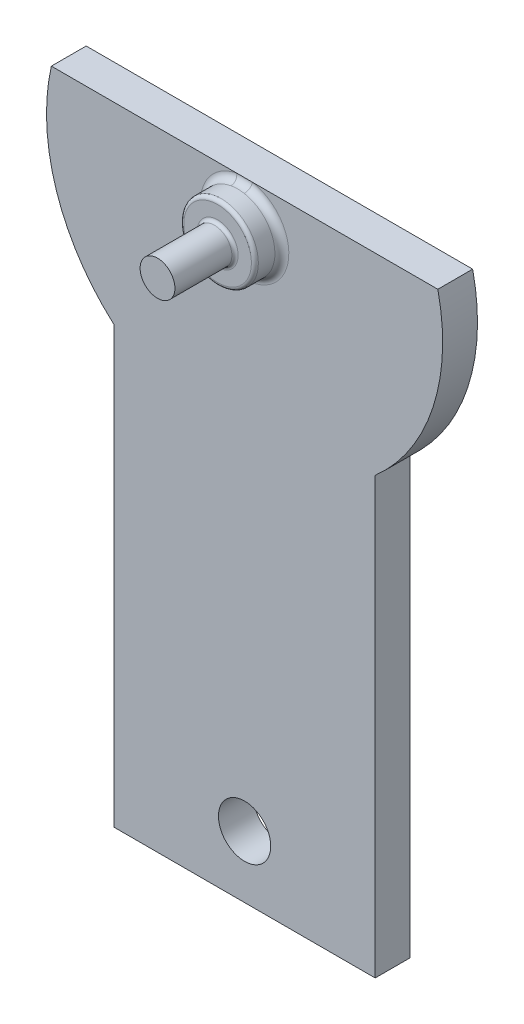
ISO-10303-21;
HEADER;
FILE_DESCRIPTION(('STEP AP214'),'2;1');
FILE_NAME('part.step','',(''),(''),'','','');
FILE_SCHEMA(('AUTOMOTIVE_DESIGN { 1 0 10303 214 1 1 1 1 }'));
ENDSEC;
DATA;
#1=APPLICATION_CONTEXT('core data for automotive mechanical design processes');
#2=APPLICATION_PROTOCOL_DEFINITION('international standard','automotive_design',2000,#1);
#3=PRODUCT_CONTEXT('',#1,'mechanical');
#4=PRODUCT('Part','Part','',(#3));
#5=PRODUCT_RELATED_PRODUCT_CATEGORY('part','',(#4));
#6=PRODUCT_DEFINITION_FORMATION('','',#4);
#7=PRODUCT_DEFINITION_CONTEXT('part definition',#1,'design');
#8=PRODUCT_DEFINITION('design','',#6,#7);
#9=PRODUCT_DEFINITION_SHAPE('','',#8);
#10=(LENGTH_UNIT() NAMED_UNIT(*) SI_UNIT(.MILLI.,.METRE.));
#11=(NAMED_UNIT(*) PLANE_ANGLE_UNIT() SI_UNIT($,.RADIAN.));
#12=(NAMED_UNIT(*) SI_UNIT($,.STERADIAN.) SOLID_ANGLE_UNIT());
#13=UNCERTAINTY_MEASURE_WITH_UNIT(LENGTH_MEASURE(1.E-05),#10,'distance_accuracy_value','');
#14=(GEOMETRIC_REPRESENTATION_CONTEXT(3) GLOBAL_UNCERTAINTY_ASSIGNED_CONTEXT((#13)) GLOBAL_UNIT_ASSIGNED_CONTEXT((#10,
#11,#12)) REPRESENTATION_CONTEXT('',''));
#15=CARTESIAN_POINT('',(0.,0.,0.));
#16=DIRECTION('',(0.,0.,1.));
#17=DIRECTION('',(1.,0.,0.));
#18=AXIS2_PLACEMENT_3D('',#15,#16,#17);
#19=CARTESIAN_POINT('',(75.,0.,20.));
#20=DIRECTION('',(-1.,0.,0.));
#21=DIRECTION('',(0.,-1.,0.));
#22=AXIS2_PLACEMENT_3D('',#19,#20,#21);
#23=PLANE('',#22);
#24=DIRECTION('',(0.,1.,0.));
#25=VECTOR('',#24,1.);
#26=CARTESIAN_POINT('',(75.,0.,0.));
#27=LINE('',#26,#25);
#28=CARTESIAN_POINT('',(75.,-335.522292415487,0.));
#29=VERTEX_POINT('',#28);
#30=CARTESIAN_POINT('',(75.,-85.5222924154866,0.));
#31=VERTEX_POINT('',#30);
#32=EDGE_CURVE('E136',#29,#31,#27,.T.);
#33=ORIENTED_EDGE('',*,*,#32,.T.);
#34=DIRECTION('',(0.,0.,-1.));
#35=VECTOR('',#34,1.);
#36=CARTESIAN_POINT('',(75.,-85.5222924154866,20.));
#37=LINE('',#36,#35);
#38=CARTESIAN_POINT('',(75.,-85.5222924154866,20.));
#39=VERTEX_POINT('',#38);
#40=EDGE_CURVE('E118',#39,#31,#37,.T.);
#41=ORIENTED_EDGE('',*,*,#40,.F.);
#42=DIRECTION('',(0.,1.,0.));
#43=VECTOR('',#42,1.);
#44=CARTESIAN_POINT('',(75.,0.,20.));
#45=LINE('',#44,#43);
#46=CARTESIAN_POINT('',(75.,-335.522292415487,20.));
#47=VERTEX_POINT('',#46);
#48=EDGE_CURVE('E123',#47,#39,#45,.T.);
#49=ORIENTED_EDGE('',*,*,#48,.F.);
#50=DIRECTION('',(0.,0.,-1.));
#51=VECTOR('',#50,1.);
#52=CARTESIAN_POINT('',(75.,-335.522292415487,20.));
#53=LINE('',#52,#51);
#54=EDGE_CURVE('E278',#47,#29,#53,.T.);
#55=ORIENTED_EDGE('',*,*,#54,.T.);
#56=EDGE_LOOP('',(#33,#41,#49,#55));
#57=FACE_BOUND('',#56,.T.);
#58=ADVANCED_FACE('F43',(#57),#23,.F.);
#59=CARTESIAN_POINT('',(0.,0.,20.));
#60=DIRECTION('',(0.,0.,-1.));
#61=DIRECTION('',(-1.,0.,0.));
#62=AXIS2_PLACEMENT_3D('',#59,#60,#61);
#63=CYLINDRICAL_SURFACE('',#62,113.75);
#64=CARTESIAN_POINT('',(0.,0.,0.));
#65=DIRECTION('',(0.,0.,1.));
#66=DIRECTION('',(1.,0.,0.));
#67=AXIS2_PLACEMENT_3D('',#64,#65,#66);
#68=CIRCLE('',#67,113.75);
#69=CARTESIAN_POINT('',(110.968745599831,25.,0.));
#70=VERTEX_POINT('',#69);
#71=EDGE_CURVE('E281',#31,#70,#68,.T.);
#72=ORIENTED_EDGE('',*,*,#71,.T.);
#73=DIRECTION('',(0.,0.,-1.));
#74=VECTOR('',#73,1.);
#75=CARTESIAN_POINT('',(110.968745599831,25.,20.));
#76=LINE('',#75,#74);
#77=CARTESIAN_POINT('',(110.968745599831,25.,20.));
#78=VERTEX_POINT('',#77);
#79=EDGE_CURVE('E120',#78,#70,#76,.T.);
#80=ORIENTED_EDGE('',*,*,#79,.F.);
#81=CARTESIAN_POINT('',(0.,0.,20.));
#82=DIRECTION('',(0.,0.,1.));
#83=DIRECTION('',(1.,0.,0.));
#84=AXIS2_PLACEMENT_3D('',#81,#82,#83);
#85=CIRCLE('',#84,113.75);
#86=EDGE_CURVE('E113',#39,#78,#85,.T.);
#87=ORIENTED_EDGE('',*,*,#86,.F.);
#88=ORIENTED_EDGE('',*,*,#40,.T.);
#89=EDGE_LOOP('',(#72,#80,#87,#88));
#90=FACE_BOUND('',#89,.T.);
#91=ADVANCED_FACE('F116',(#90),#63,.T.);
#92=CARTESIAN_POINT('',(0.,25.,20.));
#93=DIRECTION('',(0.,1.,0.));
#94=DIRECTION('',(-1.,0.,0.));
#95=AXIS2_PLACEMENT_3D('',#92,#93,#94);
#96=PLANE('',#95);
#97=DIRECTION('',(1.,0.,0.));
#98=VECTOR('',#97,1.);
#99=CARTESIAN_POINT('',(0.,25.,0.));
#100=LINE('',#99,#98);
#101=CARTESIAN_POINT('',(-110.968745599831,25.,0.));
#102=VERTEX_POINT('',#101);
#103=EDGE_CURVE('E284',#102,#70,#100,.T.);
#104=ORIENTED_EDGE('',*,*,#103,.F.);
#105=DIRECTION('',(0.,0.,-1.));
#106=VECTOR('',#105,1.);
#107=CARTESIAN_POINT('',(-110.968745599831,25.,20.));
#108=LINE('',#107,#106);
#109=CARTESIAN_POINT('',(-110.968745599831,25.,20.));
#110=VERTEX_POINT('',#109);
#111=EDGE_CURVE('E145',#110,#102,#108,.T.);
#112=ORIENTED_EDGE('',*,*,#111,.F.);
#113=DIRECTION('',(1.,0.,0.));
#114=VECTOR('',#113,1.);
#115=CARTESIAN_POINT('',(0.,25.,20.));
#116=LINE('',#115,#114);
#117=CARTESIAN_POINT('',(-4.54557193779315,25.,20.));
#118=VERTEX_POINT('',#117);
#119=EDGE_CURVE('E265',#110,#118,#116,.T.);
#120=ORIENTED_EDGE('',*,*,#119,.T.);
#121=CARTESIAN_POINT('',(4.54557193779314,25.,20.));
#122=VERTEX_POINT('',#121);
#123=EDGE_CURVE('E269',#118,#122,#116,.T.);
#124=ORIENTED_EDGE('',*,*,#123,.T.);
#125=EDGE_CURVE('E122',#122,#78,#116,.T.);
#126=ORIENTED_EDGE('',*,*,#125,.T.);
#127=ORIENTED_EDGE('',*,*,#79,.T.);
#128=EDGE_LOOP('',(#104,#112,#120,#124,#126,#127));
#129=FACE_BOUND('',#128,.T.);
#130=ADVANCED_FACE('F208',(#129),#96,.T.);
#131=CARTESIAN_POINT('',(0.,0.,20.));
#132=DIRECTION('',(0.,0.,-1.));
#133=DIRECTION('',(-1.,0.,0.));
#134=AXIS2_PLACEMENT_3D('',#131,#132,#133);
#135=CYLINDRICAL_SURFACE('',#134,113.75);
#136=CARTESIAN_POINT('',(0.,0.,0.));
#137=DIRECTION('',(0.,0.,1.));
#138=DIRECTION('',(1.,0.,0.));
#139=AXIS2_PLACEMENT_3D('',#136,#137,#138);
#140=CIRCLE('',#139,113.75);
#141=CARTESIAN_POINT('',(-75.,-85.5222924154866,0.));
#142=VERTEX_POINT('',#141);
#143=EDGE_CURVE('E288',#102,#142,#140,.T.);
#144=ORIENTED_EDGE('',*,*,#143,.T.);
#145=DIRECTION('',(0.,0.,-1.));
#146=VECTOR('',#145,1.);
#147=CARTESIAN_POINT('',(-75.,-85.5222924154866,20.));
#148=LINE('',#147,#146);
#149=CARTESIAN_POINT('',(-75.,-85.5222924154866,20.));
#150=VERTEX_POINT('',#149);
#151=EDGE_CURVE('E304',#150,#142,#148,.T.);
#152=ORIENTED_EDGE('',*,*,#151,.F.);
#153=CARTESIAN_POINT('',(0.,0.,20.));
#154=DIRECTION('',(0.,0.,1.));
#155=DIRECTION('',(1.,0.,0.));
#156=AXIS2_PLACEMENT_3D('',#153,#154,#155);
#157=CIRCLE('',#156,113.75);
#158=EDGE_CURVE('E268',#110,#150,#157,.T.);
#159=ORIENTED_EDGE('',*,*,#158,.F.);
#160=ORIENTED_EDGE('',*,*,#111,.T.);
#161=EDGE_LOOP('',(#144,#152,#159,#160));
#162=FACE_BOUND('',#161,.T.);
#163=ADVANCED_FACE('F213',(#162),#135,.T.);
#164=CARTESIAN_POINT('',(-75.,0.,20.));
#165=DIRECTION('',(-1.,0.,0.));
#166=DIRECTION('',(0.,-1.,0.));
#167=AXIS2_PLACEMENT_3D('',#164,#165,#166);
#168=PLANE('',#167);
#169=DIRECTION('',(0.,1.,0.));
#170=VECTOR('',#169,1.);
#171=CARTESIAN_POINT('',(-75.,0.,0.));
#172=LINE('',#171,#170);
#173=CARTESIAN_POINT('',(-75.,-335.522292415487,0.));
#174=VERTEX_POINT('',#173);
#175=EDGE_CURVE('E292',#174,#142,#172,.T.);
#176=ORIENTED_EDGE('',*,*,#175,.F.);
#177=DIRECTION('',(0.,0.,-1.));
#178=VECTOR('',#177,1.);
#179=CARTESIAN_POINT('',(-75.,-335.522292415487,20.));
#180=LINE('',#179,#178);
#181=CARTESIAN_POINT('',(-75.,-335.522292415487,20.));
#182=VERTEX_POINT('',#181);
#183=EDGE_CURVE('E301',#182,#174,#180,.T.);
#184=ORIENTED_EDGE('',*,*,#183,.F.);
#185=DIRECTION('',(0.,1.,0.));
#186=VECTOR('',#185,1.);
#187=CARTESIAN_POINT('',(-75.,0.,20.));
#188=LINE('',#187,#186);
#189=EDGE_CURVE('E272',#182,#150,#188,.T.);
#190=ORIENTED_EDGE('',*,*,#189,.T.);
#191=ORIENTED_EDGE('',*,*,#151,.T.);
#192=EDGE_LOOP('',(#176,#184,#190,#191));
#193=FACE_BOUND('',#192,.T.);
#194=ADVANCED_FACE('F217',(#193),#168,.T.);
#195=CARTESIAN_POINT('',(0.,-335.522292415487,20.));
#196=DIRECTION('',(0.,-1.,0.));
#197=DIRECTION('',(0.,0.,-1.));
#198=AXIS2_PLACEMENT_3D('',#195,#196,#197);
#199=PLANE('',#198);
#200=DIRECTION('',(-1.,0.,0.));
#201=VECTOR('',#200,1.);
#202=CARTESIAN_POINT('',(0.,-335.522292415487,0.));
#203=LINE('',#202,#201);
#204=EDGE_CURVE('E133',#29,#174,#203,.T.);
#205=ORIENTED_EDGE('',*,*,#204,.F.);
#206=ORIENTED_EDGE('',*,*,#54,.F.);
#207=DIRECTION('',(-1.,0.,0.));
#208=VECTOR('',#207,1.);
#209=CARTESIAN_POINT('',(0.,-335.522292415487,20.));
#210=LINE('',#209,#208);
#211=EDGE_CURVE('E130',#47,#182,#210,.T.);
#212=ORIENTED_EDGE('',*,*,#211,.T.);
#213=ORIENTED_EDGE('',*,*,#183,.T.);
#214=EDGE_LOOP('',(#205,#206,#212,#213));
#215=FACE_BOUND('',#214,.T.);
#216=ADVANCED_FACE('F221',(#215),#199,.T.);
#217=CARTESIAN_POINT('',(0.,0.,20.));
#218=DIRECTION('',(0.,0.,1.));
#219=DIRECTION('',(1.,0.,0.));
#220=AXIS2_PLACEMENT_3D('',#217,#218,#219);
#221=PLANE('',#220);
#222=CARTESIAN_POINT('',(0.,-300.,20.));
#223=DIRECTION('',(0.,0.,1.));
#224=DIRECTION('',(1.,0.,0.));
#225=AXIS2_PLACEMENT_3D('',#222,#223,#224);
#226=CIRCLE('',#225,15.);
#227=CARTESIAN_POINT('',(15.,-300.,20.));
#228=VERTEX_POINT('',#227);
#229=EDGE_CURVE('E253',#228,#228,#226,.T.);
#230=ORIENTED_EDGE('',*,*,#229,.F.);
#231=EDGE_LOOP('',(#230));
#232=FACE_BOUND('',#231,.T.);
#233=ORIENTED_EDGE('',*,*,#125,.F.);
#234=CARTESIAN_POINT('',(0.,0.,20.));
#235=DIRECTION('',(0.,0.,1.));
#236=DIRECTION('',(1.,0.,0.));
#237=AXIS2_PLACEMENT_3D('',#234,#235,#236);
#238=CIRCLE('',#237,25.4098843807219);
#239=EDGE_CURVE('E66',#122,#118,#238,.F.);
#240=ORIENTED_EDGE('',*,*,#239,.T.);
#241=ORIENTED_EDGE('',*,*,#119,.F.);
#242=ORIENTED_EDGE('',*,*,#158,.T.);
#243=ORIENTED_EDGE('',*,*,#189,.F.);
#244=ORIENTED_EDGE('',*,*,#211,.F.);
#245=ORIENTED_EDGE('',*,*,#48,.T.);
#246=ORIENTED_EDGE('',*,*,#86,.T.);
#247=EDGE_LOOP('',(#233,#240,#241,#242,#243,#244,#245,#246));
#248=FACE_BOUND('',#247,.T.);
#249=ADVANCED_FACE('F127',(#232,#248),#221,.T.);
#250=CARTESIAN_POINT('',(0.,0.,0.));
#251=DIRECTION('',(0.,0.,1.));
#252=DIRECTION('',(1.,0.,0.));
#253=AXIS2_PLACEMENT_3D('',#250,#251,#252);
#254=PLANE('',#253);
#255=CARTESIAN_POINT('',(0.,-300.,0.));
#256=DIRECTION('',(0.,0.,1.));
#257=DIRECTION('',(1.,0.,0.));
#258=AXIS2_PLACEMENT_3D('',#255,#256,#257);
#259=CIRCLE('',#258,15.);
#260=CARTESIAN_POINT('',(15.,-300.,0.));
#261=VERTEX_POINT('',#260);
#262=EDGE_CURVE('E250',#261,#261,#259,.F.);
#263=ORIENTED_EDGE('',*,*,#262,.F.);
#264=EDGE_LOOP('',(#263));
#265=FACE_BOUND('',#264,.T.);
#266=ORIENTED_EDGE('',*,*,#32,.F.);
#267=ORIENTED_EDGE('',*,*,#204,.T.);
#268=ORIENTED_EDGE('',*,*,#175,.T.);
#269=ORIENTED_EDGE('',*,*,#143,.F.);
#270=ORIENTED_EDGE('',*,*,#103,.T.);
#271=ORIENTED_EDGE('',*,*,#71,.F.);
#272=EDGE_LOOP('',(#266,#267,#268,#269,#270,#271));
#273=FACE_BOUND('',#272,.T.);
#274=ADVANCED_FACE('F226',(#265,#273),#254,.F.);
#275=CARTESIAN_POINT('',(0.,-300.,-42.4264068711929));
#276=DIRECTION('',(0.,0.,1.));
#277=DIRECTION('',(1.,0.,0.));
#278=AXIS2_PLACEMENT_3D('',#275,#276,#277);
#279=CYLINDRICAL_SURFACE('',#278,15.);
#280=ORIENTED_EDGE('',*,*,#262,.T.);
#281=EDGE_LOOP('',(#280));
#282=FACE_BOUND('',#281,.T.);
#283=ORIENTED_EDGE('',*,*,#229,.T.);
#284=EDGE_LOOP('',(#283));
#285=FACE_BOUND('',#284,.T.);
#286=ADVANCED_FACE('F228',(#282,#285),#279,.F.);
#287=CARTESIAN_POINT('',(0.,0.,35.5));
#288=DIRECTION('',(0.,0.,-1.));
#289=DIRECTION('',(-1.,0.,0.));
#290=AXIS2_PLACEMENT_3D('',#287,#288,#289);
#291=CYLINDRICAL_SURFACE('',#290,21.4098843807219);
#292=CARTESIAN_POINT('',(0.,0.,33.5));
#293=DIRECTION('',(0.,0.,1.));
#294=DIRECTION('',(1.,0.,0.));
#295=AXIS2_PLACEMENT_3D('',#292,#293,#294);
#296=CIRCLE('',#295,21.4098843807219);
#297=CARTESIAN_POINT('',(21.4098843807219,0.,33.5));
#298=VERTEX_POINT('',#297);
#299=EDGE_CURVE('E11',#298,#298,#296,.F.);
#300=ORIENTED_EDGE('',*,*,#299,.T.);
#301=EDGE_LOOP('',(#300));
#302=FACE_BOUND('',#301,.T.);
#303=CARTESIAN_POINT('',(0.,0.,24.));
#304=DIRECTION('',(0.,0.,1.));
#305=DIRECTION('',(1.,0.,0.));
#306=AXIS2_PLACEMENT_3D('',#303,#304,#305);
#307=CIRCLE('',#306,21.4098843807219);
#308=CARTESIAN_POINT('',(-3.83001229656286,21.0645236120843,24.));
#309=VERTEX_POINT('',#308);
#310=CARTESIAN_POINT('',(3.83001229656285,21.0645236120843,24.));
#311=VERTEX_POINT('',#310);
#312=EDGE_CURVE('E152',#309,#311,#307,.T.);
#313=ORIENTED_EDGE('',*,*,#312,.T.);
#314=CARTESIAN_POINT('',(5.7075348434375,20.6350962005711,23.9673983388267));
#315=CARTESIAN_POINT('',(5.55825278836147,20.6763866565285,19.4445829960074));
#316=CARTESIAN_POINT('',(6.77387125926173,25.,20.));
#317=CARTESIAN_POINT('',(5.42052206573362,20.7144888326897,23.9794047773404));
#318=CARTESIAN_POINT('',(5.3125778513512,20.7423181915382,19.5561697644472));
#319=CARTESIAN_POINT('',(6.43323600091326,25.,20.));
#320=CARTESIAN_POINT('',(5.13177482391666,20.7879017855618,23.9872838232575));
#321=CARTESIAN_POINT('',(5.05304951017219,20.8070881620184,19.6552657488071));
#322=CARTESIAN_POINT('',(6.09054222922588,25.,20.));
#323=CARTESIAN_POINT('',(4.55143690093348,20.9226245536996,23.9972810470081));
#324=CARTESIAN_POINT('',(4.51917889407749,20.9292217875133,19.828953362693));
#325=CARTESIAN_POINT('',(5.40178000788328,25.,20.));
#326=CARTESIAN_POINT('',(4.25984662127558,20.9839360527403,23.9994000268117));
#327=CARTESIAN_POINT('',(4.24411305045407,20.9869696535681,19.9043744085272));
#328=CARTESIAN_POINT('',(5.05571203475005,25.,20.));
#329=CARTESIAN_POINT('',(3.67444630378126,21.0943195260598,24.0003728592227));
#330=CARTESIAN_POINT('',(3.68365909696139,21.0925165550538,20.0348915743263));
#331=CARTESIAN_POINT('',(4.36094161378667,25.,20.));
#332=CARTESIAN_POINT('',(3.38063688169646,21.1433947756819,23.9992275866127));
#333=CARTESIAN_POINT('',(3.39741448724871,21.1406696512413,20.0905555481101));
#334=CARTESIAN_POINT('',(4.01223989674878,25.,20.));
#335=CARTESIAN_POINT('',(2.79122375363878,21.229246551962,23.9955468617783));
#336=CARTESIAN_POINT('',(2.81780440311764,21.2256528333536,20.184895174965));
#337=CARTESIAN_POINT('',(3.31270695345507,25.,20.));
#338=CARTESIAN_POINT('',(2.49561999438993,21.2660227116089,23.9930113680749));
#339=CARTESIAN_POINT('',(2.52349822939404,21.2627701407225,20.2239430139266));
#340=CARTESIAN_POINT('',(2.96187566396974,25.,20.));
#341=CARTESIAN_POINT('',(1.91106399821659,21.3263920627983,23.988064316562));
#342=CARTESIAN_POINT('',(1.93834449867579,21.3239351464843,20.2865904317376));
#343=CARTESIAN_POINT('',(2.26810730853682,25.,20.));
#344=CARTESIAN_POINT('',(1.62214541902862,21.3503116601796,23.9856512578522));
#345=CARTESIAN_POINT('',(1.64675603551729,21.3484967436039,20.3107871790275));
#346=CARTESIAN_POINT('',(1.92521018858697,25.,20.));
#347=CARTESIAN_POINT('',(1.04357100627298,21.3864003416042,23.9817748281013));
#348=CARTESIAN_POINT('',(1.06152673095128,21.3855587810529,20.346812829737));
#349=CARTESIAN_POINT('',(1.23854095337137,25.,20.));
#350=CARTESIAN_POINT('',(0.753915176106196,21.3985694797533,23.9803114526872));
#351=CARTESIAN_POINT('',(0.766949390843069,21.398178949319,20.3587613045963));
#352=CARTESIAN_POINT('',(0.89476884214188,25.,20.));
#353=CARTESIAN_POINT('',(0.174316223668689,21.4111371678384,23.9787975393359));
#354=CARTESIAN_POINT('',(0.177691028710451,21.4111717201094,20.3710572808817));
#355=CARTESIAN_POINT('',(0.206883652911912,25.,20.));
#356=CARTESIAN_POINT('',(-0.115626924627951,21.4115345306629,23.978747143889));
#357=CARTESIAN_POINT('',(-0.117938598571501,21.4115850572949,20.3714433489562));
#358=CARTESIAN_POINT('',(-0.137229455976898,25.,20.));
#359=CARTESIAN_POINT('',(-0.695291036907792,21.4005549867059,23.9800743005006));
#360=CARTESIAN_POINT('',(-0.707359449234024,21.4002319403523,20.3607082711641));
#361=CARTESIAN_POINT('',(-0.825191978836061,25.,20.));
#362=CARTESIAN_POINT('',(-0.985011998052651,21.3891779319385,23.9814518705063));
#363=CARTESIAN_POINT('',(-1.00209964249353,21.3884286597424,20.3495523180493));
#364=CARTESIAN_POINT('',(-1.16904138943779,25.,20.));
#365=CARTESIAN_POINT('',(-1.56801068583592,21.3544144554588,23.9852308478996));
#366=CARTESIAN_POINT('',(-1.59212314465174,21.3527017341211,20.3149161172663));
#367=CARTESIAN_POINT('',(-1.86096148518687,25.,20.));
#368=CARTESIAN_POINT('',(-1.86127795172685,21.3308536270185,23.9876470356017));
#369=CARTESIAN_POINT('',(-1.88830260238057,21.3284844279209,20.2911398062293));
#370=CARTESIAN_POINT('',(-2.20901975520956,25.,20.));
#371=CARTESIAN_POINT('',(-2.44658645388118,21.2716686110651,23.9925929358791));
#372=CARTESIAN_POINT('',(-2.47455410042365,21.2684741082518,20.2298801979478));
#373=CARTESIAN_POINT('',(-2.90368120701005,25.,20.));
#374=CARTESIAN_POINT('',(-2.73862771090588,21.2360446286712,23.9951226465233));
#375=CARTESIAN_POINT('',(-2.76558065208639,21.2324819449098,20.1921778881901));
#376=CARTESIAN_POINT('',(-3.25028441342799,25.,20.));
#377=CARTESIAN_POINT('',(-3.32088933924363,21.1528082682454,23.9989328526331));
#378=CARTESIAN_POINT('',(-3.33894059614374,21.1499341006588,20.1010875551301));
#379=CARTESIAN_POINT('',(-3.94132974521514,25.,20.));
#380=CARTESIAN_POINT('',(-3.6111103707284,21.1052005292395,24.000213830562));
#381=CARTESIAN_POINT('',(-3.62218747892107,21.1031098054271,20.0473563687872));
#382=CARTESIAN_POINT('',(-4.28577265409569,25.,20.));
#383=CARTESIAN_POINT('',(-4.18934216428643,20.9980717549014,23.999727683232));
#384=CARTESIAN_POINT('',(-4.17711459421277,21.0003762316824,19.9214649795165));
#385=CARTESIAN_POINT('',(-4.9720352587069,25.,20.));
#386=CARTESIAN_POINT('',(-4.47735296321095,20.9385509186466,23.9979606089048));
#387=CARTESIAN_POINT('',(-4.44963026371183,20.9441335278427,19.8487800126457));
#388=CARTESIAN_POINT('',(-5.31385499817374,25.,20.));
#389=CARTESIAN_POINT('',(-5.05894550156346,20.8058101418748,23.9890013439626));
#390=CARTESIAN_POINT('',(-4.98711754801475,20.8229857250079,19.6789654478076));
#391=CARTESIAN_POINT('',(-6.00410623417014,25.,20.));
#392=CARTESIAN_POINT('',(-5.35244678859052,20.7322431753569,23.9816534102871));
#393=CARTESIAN_POINT('',(-5.25224954116209,20.7575136927855,19.5804110388448));
#394=CARTESIAN_POINT('',(-6.35244224740963,25.,20.));
#395=CARTESIAN_POINT('',(-5.93577928451098,20.572823691931,23.9583506273318));
#396=CARTESIAN_POINT('',(-5.76049140431901,20.6228944829977,19.3553211918911));
#397=CARTESIAN_POINT('',(-7.04475851651743,25.,20.));
#398=CARTESIAN_POINT('',(-6.22561144426765,20.4869744320156,23.9423980567148));
#399=CARTESIAN_POINT('',(-6.00415226524425,20.5533564646746,19.2275698285914));
#400=CARTESIAN_POINT('',(-7.38873990089837,25.,20.));
#401=CARTESIAN_POINT('',(-6.80148550833567,20.3030653080997,23.898171252644));
#402=CARTESIAN_POINT('',(-6.46199128580204,20.4159716621894,18.9379818460068));
#403=CARTESIAN_POINT('',(-8.07220428244174,25.,20.));
#404=CARTESIAN_POINT('',(-7.08751747594724,20.2049785410791,23.8698695173296));
#405=CARTESIAN_POINT('',(-6.67621639143087,20.3478644802205,18.7743003678967));
#406=CARTESIAN_POINT('',(-8.41167548643504,25.,20.));
#407=CARTESIAN_POINT('',(-7.5123652392357,20.049197387746,23.8147156773895));
#408=CARTESIAN_POINT('',(-6.96301000873124,20.2547156030239,18.5011993007536));
#409=CARTESIAN_POINT('',(-8.91589738467823,25.,20.));
#410=CARTESIAN_POINT('',(-7.6533530453105,19.9957986074969,23.794200272702));
#411=CARTESIAN_POINT('',(-7.05412088977342,20.2247337202337,18.4037667592783));
#412=CARTESIAN_POINT('',(-9.08322588523425,25.,20.));
#413=CARTESIAN_POINT('',(-7.93370363196386,19.8862306905858,23.748215239325));
#414=CARTESIAN_POINT('',(-7.22338757844858,20.1692152842611,18.1978208430482));
#415=CARTESIAN_POINT('',(-9.41595425802607,25.,20.));
#416=CARTESIAN_POINT('',(-8.07306603289534,19.8300609221131,23.7227444768349));
#417=CARTESIAN_POINT('',(-7.30137994784735,20.1437365362118,18.0889317560691));
#418=CARTESIAN_POINT('',(-9.58135367968546,25.,20.));
#419=CARTESIAN_POINT('',(-8.21149686002546,19.7725685866473,23.6944414607385));
#420=CARTESIAN_POINT('',(-7.37073755435466,20.1217337630531,17.9753382798371));
#421=CARTESIAN_POINT('',(-9.74564748204738,25.,20.));
#422=(BOUNDED_SURFACE() B_SPLINE_SURFACE(3,2,((#314,#315,#316),(#317,#318,#319),(#320,#321,
#322),(#323,#324,#325),(#326,#327,#328),(#329,#330,#331),(#332,#333,#334),(#335,#336,#337),
(#338,#339,#340),(#341,#342,#343),(#344,#345,#346),(#347,#348,#349),(#350,#351,#352),(#353,#354,
#355),(#356,#357,#358),(#359,#360,#361),(#362,#363,#364),(#365,#366,#367),(#368,#369,#370),
(#371,#372,#373),(#374,#375,#376),(#377,#378,#379),(#380,#381,#382),(#383,#384,#385),(#386,#387,
#388),(#389,#390,#391),(#392,#393,#394),(#395,#396,#397),(#398,#399,#400),(#401,#402,#403),
(#404,#405,#406),(#407,#408,#409),(#410,#411,#412),(#413,#414,#415),(#416,#417,#418),(#419,#420,
#421)),.UNSPECIFIED.,.F.,.F.,.F.) B_SPLINE_SURFACE_WITH_KNOTS((4,2,2,2,2,2,2,2,2,2,2,2,2,2,2,2,
2,4),(3,3),(0.,1.06072503664414,2.12130238168027,3.1815955307064,4.24192031659199,
5.27387412678214,6.3058231852576,7.33787630913086,8.36994240444213,9.41720882347648,
10.4644574359163,11.5113012702393,12.558127612418,13.6352924080745,14.7121720910645,
15.7914623476649,16.3316672222977,16.871995843082),(0.,1.),
.UNSPECIFIED.) GEOMETRIC_REPRESENTATION_ITEM() RATIONAL_B_SPLINE_SURFACE(((1.,0.662267552276523,
1.),(1.,0.670656841111851,1.),(1.,0.678359284446432,1.),(1.,0.692420998262662,1.),(1.,
0.69878045561363,1.),(1.,0.710187505693401,1.),(1.,0.715235449497392,1.),(1.,0.724042653986419,
1.),(1.,0.727801876215437,1.),(1.,0.733962332712332,1.),(1.,0.736397211150767,1.),(1.,
0.740067794582941,1.),(1.,0.741303505098319,1.),(1.,0.74257965385437,1.),(1.,0.742619971546986,
1.),(1.,0.741505143250568,1.),(1.,0.740349982236251,1.),(1.,0.736814772959297,1.),(1.,
0.734416935065223,1.),(1.,0.728378605999636,1.),(1.,0.724738135957559,1.),(1.,0.716202705713834,
1.),(1.,0.711308230936297,1.),(1.,0.700244230344835,1.),(1.,0.69407472583763,1.),(1.,
0.680235051591772,1.),(1.,0.67252657241665,1.),(1.,0.655692979821623,1.),(1.,0.646568241907951,
1.),(1.,0.626828377401457,1.),(1.,0.616209960325585,1.),(1.,0.599132081584226,1.),(1.,
0.593244399303709,1.),(1.,0.581078371120374,1.),(1.,0.574799936036164,1.),(1.,0.568323259972087,1.))) REPRESENTATION_ITEM('') SURFACE());
#423=CARTESIAN_POINT('',(5.7075348434375,20.6350962005711,23.9673983388267));
#424=CARTESIAN_POINT('',(5.42052206573362,20.7144888326897,23.9794047773404));
#425=CARTESIAN_POINT('',(5.13177482391667,20.7879017855618,23.9872838232575));
#426=CARTESIAN_POINT('',(4.55143690093348,20.9226245536996,23.9972810470081));
#427=CARTESIAN_POINT('',(4.25984662127558,20.9839360527403,23.9994000268117));
#428=CARTESIAN_POINT('',(3.67444630378126,21.0943195260598,24.0003728592227));
#429=CARTESIAN_POINT('',(3.38063688169646,21.1433947756819,23.9992275866127));
#430=CARTESIAN_POINT('',(2.79122375363878,21.229246551962,23.9955468617783));
#431=CARTESIAN_POINT('',(2.49561999438993,21.2660227116089,23.9930113680749));
#432=CARTESIAN_POINT('',(1.91106399821659,21.3263920627983,23.988064316562));
#433=CARTESIAN_POINT('',(1.62214541902862,21.3503116601796,23.9856512578522));
#434=CARTESIAN_POINT('',(1.04357100627298,21.3864003416042,23.9817748281013));
#435=CARTESIAN_POINT('',(0.753915176106196,21.3985694797533,23.9803114526872));
#436=CARTESIAN_POINT('',(0.174316223668689,21.4111371678384,23.9787975393359));
#437=CARTESIAN_POINT('',(-0.115626924627951,21.4115345306629,23.978747143889));
#438=CARTESIAN_POINT('',(-0.695291036907792,21.4005549867059,23.9800743005006));
#439=CARTESIAN_POINT('',(-0.985011998052651,21.3891779319385,23.9814518705063));
#440=CARTESIAN_POINT('',(-1.56801068583592,21.3544144554588,23.9852308478996));
#441=CARTESIAN_POINT('',(-1.86127795172685,21.3308536270185,23.9876470356017));
#442=CARTESIAN_POINT('',(-2.44658645388118,21.2716686110651,23.9925929358791));
#443=CARTESIAN_POINT('',(-2.73862771090588,21.2360446286712,23.9951226465233));
#444=CARTESIAN_POINT('',(-3.32088933924363,21.1528082682454,23.9989328526331));
#445=CARTESIAN_POINT('',(-3.6111103707284,21.1052005292395,24.000213830562));
#446=CARTESIAN_POINT('',(-4.18934216428643,20.9980717549014,23.999727683232));
#447=CARTESIAN_POINT('',(-4.47735296321095,20.9385509186466,23.9979606089048));
#448=CARTESIAN_POINT('',(-5.05894550156346,20.8058101418748,23.9890013439626));
#449=CARTESIAN_POINT('',(-5.35244678859051,20.7322431753569,23.9816534102871));
#450=CARTESIAN_POINT('',(-5.93577928451098,20.572823691931,23.9583506273318));
#451=CARTESIAN_POINT('',(-6.22561144426765,20.4869744320156,23.9423980567148));
#452=CARTESIAN_POINT('',(-6.80148550833567,20.3030653080997,23.898171252644));
#453=CARTESIAN_POINT('',(-7.08751747594724,20.2049785410791,23.8698695173296));
#454=CARTESIAN_POINT('',(-7.5123652392357,20.049197387746,23.8147156773895));
#455=CARTESIAN_POINT('',(-7.6533530453105,19.9957986074969,23.794200272702));
#456=CARTESIAN_POINT('',(-7.93370363196387,19.8862306905858,23.748215239325));
#457=CARTESIAN_POINT('',(-8.07306603289534,19.8300609221131,23.7227444768349));
#458=CARTESIAN_POINT('',(-8.21149686002546,19.7725685866473,23.6944414607385));
#459=B_SPLINE_CURVE_WITH_KNOTS('',3,(#423,#424,#425,#426,#427,#428,#429,#430,#431,#432,#433,
#434,#435,#436,#437,#438,#439,#440,#441,#442,#443,#444,#445,#446,#447,#448,#449,#450,#451,#452,
#453,#454,#455,#456,#457,#458),.UNSPECIFIED.,.F.,.F.,(4,2,2,2,2,2,2,2,2,2,2,2,2,2,2,2,2,4),(0.,
1.06072503664414,2.12130238168027,3.1815955307064,4.24192031659199,5.27387412678214,
6.3058231852576,7.33787630913086,8.36994240444213,9.41720882347648,10.4644574359163,
11.5113012702393,12.558127612418,13.6352924080745,14.7121720910645,15.7914623476649,
16.3316672222977,16.871995843082),.UNSPECIFIED.);
#460=EDGE_CURVE('E155',#311,#309,#459,.T.);
#461=ORIENTED_EDGE('',*,*,#460,.T.);
#462=EDGE_LOOP('',(#313,#461));
#463=FACE_BOUND('',#462,.T.);
#464=ADVANCED_FACE('F166',(#302,#463),#291,.T.);
#465=CARTESIAN_POINT('',(0.,0.,35.5));
#466=DIRECTION('',(0.,0.,1.));
#467=DIRECTION('',(1.,0.,0.));
#468=AXIS2_PLACEMENT_3D('',#465,#466,#467);
#469=PLANE('',#468);
#470=CARTESIAN_POINT('',(0.,0.,35.5));
#471=DIRECTION('',(0.,0.,1.));
#472=DIRECTION('',(1.,0.,0.));
#473=AXIS2_PLACEMENT_3D('',#470,#471,#472);
#474=CIRCLE('',#473,19.4098843807219);
#475=CARTESIAN_POINT('',(19.4098843807219,0.,35.5));
#476=VERTEX_POINT('',#475);
#477=EDGE_CURVE('E52',#476,#476,#474,.T.);
#478=ORIENTED_EDGE('',*,*,#477,.T.);
#479=EDGE_LOOP('',(#478));
#480=FACE_BOUND('',#479,.T.);
#481=CARTESIAN_POINT('',(0.,0.,35.5));
#482=DIRECTION('',(0.,0.,1.));
#483=DIRECTION('',(1.,0.,0.));
#484=AXIS2_PLACEMENT_3D('',#481,#482,#483);
#485=CIRCLE('',#484,11.8);
#486=CARTESIAN_POINT('',(11.8,0.,35.5));
#487=VERTEX_POINT('',#486);
#488=EDGE_CURVE('E143',#487,#487,#485,.F.);
#489=ORIENTED_EDGE('',*,*,#488,.T.);
#490=EDGE_LOOP('',(#489));
#491=FACE_BOUND('',#490,.T.);
#492=ADVANCED_FACE('F237',(#480,#491),#469,.T.);
#493=CARTESIAN_POINT('',(218.892891728432,-601.40327730298,70.));
#494=DIRECTION('',(0.,0.,1.));
#495=DIRECTION('',(-0.342020143325673,0.939692620785907,0.));
#496=AXIS2_PLACEMENT_3D('',#493,#494,#495);
#497=PLANE('',#496);
#498=CARTESIAN_POINT('',(0.,0.,70.));
#499=DIRECTION('',(0.,0.,1.));
#500=DIRECTION('',(1.,0.,0.));
#501=AXIS2_PLACEMENT_3D('',#498,#499,#500);
#502=CIRCLE('',#501,10.);
#503=CARTESIAN_POINT('',(10.,0.,70.));
#504=VERTEX_POINT('',#503);
#505=EDGE_CURVE('E258',#504,#504,#502,.T.);
#506=ORIENTED_EDGE('',*,*,#505,.T.);
#507=EDGE_LOOP('',(#506));
#508=FACE_BOUND('',#507,.T.);
#509=ADVANCED_FACE('F234',(#508),#497,.T.);
#510=CARTESIAN_POINT('',(0.,0.,98.2842712474619));
#511=DIRECTION('',(0.,0.,-1.));
#512=DIRECTION('',(-1.,0.,0.));
#513=AXIS2_PLACEMENT_3D('',#510,#511,#512);
#514=CYLINDRICAL_SURFACE('',#513,10.);
#515=CARTESIAN_POINT('',(0.,0.,37.3));
#516=DIRECTION('',(0.,0.,1.));
#517=DIRECTION('',(1.,0.,0.));
#518=AXIS2_PLACEMENT_3D('',#515,#516,#517);
#519=CIRCLE('',#518,10.);
#520=CARTESIAN_POINT('',(10.,0.,37.3));
#521=VERTEX_POINT('',#520);
#522=EDGE_CURVE('E138',#521,#521,#519,.T.);
#523=ORIENTED_EDGE('',*,*,#522,.T.);
#524=EDGE_LOOP('',(#523));
#525=FACE_BOUND('',#524,.T.);
#526=ORIENTED_EDGE('',*,*,#505,.F.);
#527=EDGE_LOOP('',(#526));
#528=FACE_BOUND('',#527,.T.);
#529=ADVANCED_FACE('F201',(#525,#528),#514,.T.);
#530=CARTESIAN_POINT('',(0.,0.,37.3));
#531=DIRECTION('',(0.,0.,1.));
#532=DIRECTION('',(1.,0.,0.));
#533=AXIS2_PLACEMENT_3D('',#530,#531,#532);
#534=TOROIDAL_SURFACE('',#533,11.8,1.8);
#535=ORIENTED_EDGE('',*,*,#488,.F.);
#536=EDGE_LOOP('',(#535));
#537=FACE_BOUND('',#536,.T.);
#538=ORIENTED_EDGE('',*,*,#522,.F.);
#539=EDGE_LOOP('',(#538));
#540=FACE_BOUND('',#539,.T.);
#541=ADVANCED_FACE('F173',(#537,#540),#534,.F.);
#542=CARTESIAN_POINT('',(0.,0.,24.));
#543=DIRECTION('',(0.,0.,1.));
#544=DIRECTION('',(1.,0.,0.));
#545=AXIS2_PLACEMENT_3D('',#542,#543,#544);
#546=TOROIDAL_SURFACE('',#545,25.4098843807219,4.);
#547=CARTESIAN_POINT('',(-4.54557193779315,25.,24.));
#548=DIRECTION('',(-0.983869096978937,-0.178889910307574,0.));
#549=DIRECTION('',(0.178889910307574,-0.983869096978937,0.));
#550=AXIS2_PLACEMENT_3D('',#547,#548,#549);
#551=CIRCLE('',#550,4.);
#552=EDGE_CURVE('E260',#118,#309,#551,.T.);
#553=ORIENTED_EDGE('',*,*,#552,.F.);
#554=ORIENTED_EDGE('',*,*,#239,.F.);
#555=CARTESIAN_POINT('',(4.54557193779315,25.,24.));
#556=DIRECTION('',(0.983869096978937,-0.178889910307573,0.));
#557=DIRECTION('',(0.178889910307573,0.983869096978937,0.));
#558=AXIS2_PLACEMENT_3D('',#555,#556,#557);
#559=CIRCLE('',#558,4.);
#560=EDGE_CURVE('E59',#311,#122,#559,.T.);
#561=ORIENTED_EDGE('',*,*,#560,.F.);
#562=ORIENTED_EDGE('',*,*,#312,.F.);
#563=EDGE_LOOP('',(#553,#554,#561,#562));
#564=FACE_BOUND('',#563,.T.);
#565=ADVANCED_FACE('F180',(#564),#546,.F.);
#566=ORIENTED_EDGE('',*,*,#560,.T.);
#567=ORIENTED_EDGE('',*,*,#123,.F.);
#568=ORIENTED_EDGE('',*,*,#552,.T.);
#569=ORIENTED_EDGE('',*,*,#460,.F.);
#570=EDGE_LOOP('',(#566,#567,#568,#569));
#571=FACE_BOUND('',#570,.T.);
#572=ADVANCED_FACE('F175',(#571),#422,.F.);
#573=CARTESIAN_POINT('',(0.,0.,33.5));
#574=DIRECTION('',(0.,0.,1.));
#575=DIRECTION('',(1.,0.,0.));
#576=AXIS2_PLACEMENT_3D('',#573,#574,#575);
#577=TOROIDAL_SURFACE('',#576,19.4098843807219,2.);
#578=ORIENTED_EDGE('',*,*,#299,.F.);
#579=EDGE_LOOP('',(#578));
#580=FACE_BOUND('',#579,.T.);
#581=ORIENTED_EDGE('',*,*,#477,.F.);
#582=EDGE_LOOP('',(#581));
#583=FACE_BOUND('',#582,.T.);
#584=ADVANCED_FACE('F45',(#580,#583),#577,.T.);
#585=CLOSED_SHELL('',(#58,#91,#130,#163,#194,#216,#249,#274,#286,#464,#492,#509,#529,#541,#565,
#572,#584));
#586=MANIFOLD_SOLID_BREP('B2',#585);
#587=ADVANCED_BREP_SHAPE_REPRESENTATION('',(#18,#586),#14);
#588=SHAPE_DEFINITION_REPRESENTATION(#9,#587);
ENDSEC;
END-ISO-10303-21;
